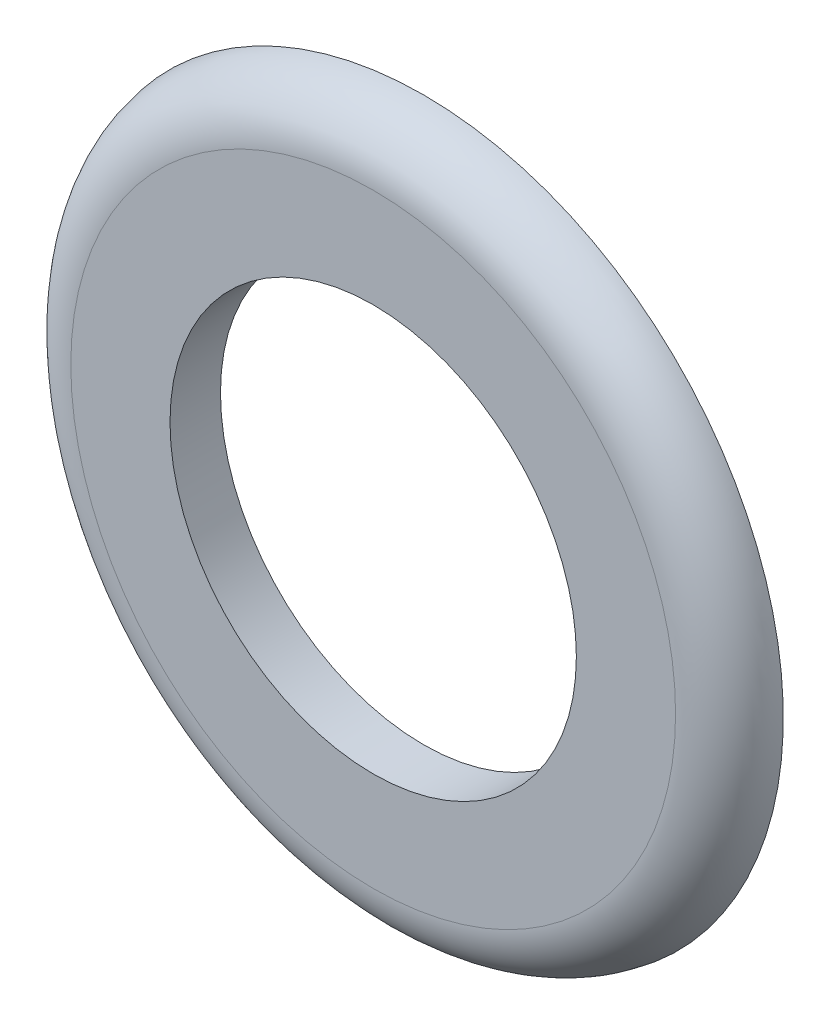
ISO-10303-21;
HEADER;
FILE_DESCRIPTION(('STEP AP214'),'2;1');
FILE_NAME('part.step','',(''),(''),'','','');
FILE_SCHEMA(('AUTOMOTIVE_DESIGN { 1 0 10303 214 1 1 1 1 }'));
ENDSEC;
DATA;
#1=APPLICATION_CONTEXT('core data for automotive mechanical design processes');
#2=APPLICATION_PROTOCOL_DEFINITION('international standard','automotive_design',2000,#1);
#3=PRODUCT_CONTEXT('',#1,'mechanical');
#4=PRODUCT('Part','Part','',(#3));
#5=PRODUCT_RELATED_PRODUCT_CATEGORY('part','',(#4));
#6=PRODUCT_DEFINITION_FORMATION('','',#4);
#7=PRODUCT_DEFINITION_CONTEXT('part definition',#1,'design');
#8=PRODUCT_DEFINITION('design','',#6,#7);
#9=PRODUCT_DEFINITION_SHAPE('','',#8);
#10=(LENGTH_UNIT() NAMED_UNIT(*) SI_UNIT(.MILLI.,.METRE.));
#11=(NAMED_UNIT(*) PLANE_ANGLE_UNIT() SI_UNIT($,.RADIAN.));
#12=(NAMED_UNIT(*) SI_UNIT($,.STERADIAN.) SOLID_ANGLE_UNIT());
#13=UNCERTAINTY_MEASURE_WITH_UNIT(LENGTH_MEASURE(1.E-05),#10,'distance_accuracy_value','');
#14=(GEOMETRIC_REPRESENTATION_CONTEXT(3) GLOBAL_UNCERTAINTY_ASSIGNED_CONTEXT((#13)) GLOBAL_UNIT_ASSIGNED_CONTEXT((#10,
#11,#12)) REPRESENTATION_CONTEXT('',''));
#15=CARTESIAN_POINT('',(0.,0.,0.));
#16=DIRECTION('',(0.,0.,1.));
#17=DIRECTION('',(1.,0.,0.));
#18=AXIS2_PLACEMENT_3D('',#15,#16,#17);
#19=CARTESIAN_POINT('',(0.,3.16666666666667,4.77139999999999));
#20=DIRECTION('',(0.,0.,1.));
#21=DIRECTION('',(0.,-1.,0.));
#22=AXIS2_PLACEMENT_3D('',#19,#20,#21);
#23=PLANE('',#22);
#24=CARTESIAN_POINT('',(0.,0.,4.77139999999999));
#25=DIRECTION('',(0.,0.,-1.));
#26=DIRECTION('',(0.,1.,0.));
#27=AXIS2_PLACEMENT_3D('',#24,#25,#26);
#28=CIRCLE('',#27,2.12772233940292);
#29=CARTESIAN_POINT('',(0.,2.12772233940292,4.77139999999999));
#30=VERTEX_POINT('',#29);
#31=EDGE_CURVE('E21',#30,#30,#28,.T.);
#32=ORIENTED_EDGE('',*,*,#31,.T.);
#33=EDGE_LOOP('',(#32));
#34=FACE_BOUND('',#33,.T.);
#35=CARTESIAN_POINT('',(0.,0.,4.7714));
#36=DIRECTION('',(0.,0.,-1.));
#37=DIRECTION('',(0.,1.,0.));
#38=AXIS2_PLACEMENT_3D('',#35,#36,#37);
#39=CIRCLE('',#38,3.16666666666668);
#40=CARTESIAN_POINT('',(0.,3.16666666666667,4.77139999999999));
#41=VERTEX_POINT('',#40);
#42=CARTESIAN_POINT('',(0.,-3.16666666666668,4.77139999999999));
#43=VERTEX_POINT('',#42);
#44=EDGE_CURVE('E33',#41,#43,#39,.T.);
#45=ORIENTED_EDGE('',*,*,#44,.F.);
#46=CARTESIAN_POINT('',(0.,0.,4.7714));
#47=DIRECTION('',(0.,0.,-1.));
#48=DIRECTION('',(0.,-1.,0.));
#49=AXIS2_PLACEMENT_3D('',#46,#47,#48);
#50=CIRCLE('',#49,3.16666666666667);
#51=EDGE_CURVE('E36',#43,#41,#50,.T.);
#52=ORIENTED_EDGE('',*,*,#51,.F.);
#53=EDGE_LOOP('',(#45,#52));
#54=FACE_BOUND('',#53,.T.);
#55=ADVANCED_FACE('F17',(#34,#54),#23,.T.);
#56=CARTESIAN_POINT('',(0.,0.,4.16666666666666));
#57=DIRECTION('',(0.,0.,-1.));
#58=DIRECTION('',(0.,1.,0.));
#59=AXIS2_PLACEMENT_3D('',#56,#57,#58);
#60=TOROIDAL_SURFACE('',#59,3.16666666666667,0.604733333333332);
#61=ORIENTED_EDGE('',*,*,#44,.T.);
#62=ORIENTED_EDGE('',*,*,#51,.T.);
#63=EDGE_LOOP('',(#61,#62));
#64=FACE_BOUND('',#63,.T.);
#65=CARTESIAN_POINT('',(0.,0.,4.24286666666666));
#66=DIRECTION('',(0.,0.,-1.));
#67=DIRECTION('',(0.,1.,0.));
#68=AXIS2_PLACEMENT_3D('',#65,#66,#67);
#69=CIRCLE('',#68,3.76657996410593);
#70=CARTESIAN_POINT('',(0.,3.76657996410593,4.24286666666666));
#71=VERTEX_POINT('',#70);
#72=EDGE_CURVE('E27',#71,#71,#69,.T.);
#73=ORIENTED_EDGE('',*,*,#72,.F.);
#74=EDGE_LOOP('',(#73));
#75=FACE_BOUND('',#74,.T.);
#76=ADVANCED_FACE('F43',(#64,#75),#60,.T.);
#77=CARTESIAN_POINT('',(0.,0.,4.24286666666666));
#78=DIRECTION('',(0.,0.,-1.));
#79=DIRECTION('',(0.,1.,0.));
#80=AXIS2_PLACEMENT_3D('',#77,#78,#79);
#81=CYLINDRICAL_SURFACE('',#80,2.12772233940292);
#82=CARTESIAN_POINT('',(0.,0.,4.24286666666666));
#83=DIRECTION('',(0.,0.,-1.));
#84=DIRECTION('',(0.,1.,0.));
#85=AXIS2_PLACEMENT_3D('',#82,#83,#84);
#86=CIRCLE('',#85,2.12772233940292);
#87=CARTESIAN_POINT('',(0.,2.12772233940292,4.24286666666666));
#88=VERTEX_POINT('',#87);
#89=EDGE_CURVE('E11',#88,#88,#86,.F.);
#90=ORIENTED_EDGE('',*,*,#89,.F.);
#91=EDGE_LOOP('',(#90));
#92=FACE_BOUND('',#91,.T.);
#93=ORIENTED_EDGE('',*,*,#31,.F.);
#94=EDGE_LOOP('',(#93));
#95=FACE_BOUND('',#94,.T.);
#96=ADVANCED_FACE('F60',(#92,#95),#81,.F.);
#97=CARTESIAN_POINT('',(0.,2.12772233940292,4.24286666666666));
#98=DIRECTION('',(0.,0.,-1.));
#99=DIRECTION('',(0.,1.,0.));
#100=AXIS2_PLACEMENT_3D('',#97,#98,#99);
#101=PLANE('',#100);
#102=ORIENTED_EDGE('',*,*,#89,.T.);
#103=EDGE_LOOP('',(#102));
#104=FACE_BOUND('',#103,.T.);
#105=ORIENTED_EDGE('',*,*,#72,.T.);
#106=EDGE_LOOP('',(#105));
#107=FACE_BOUND('',#106,.T.);
#108=ADVANCED_FACE('F86',(#104,#107),#101,.T.);
#109=CLOSED_SHELL('',(#55,#76,#96,#108));
#110=MANIFOLD_SOLID_BREP('B1',#109);
#111=ADVANCED_BREP_SHAPE_REPRESENTATION('',(#18,#110),#14);
#112=SHAPE_DEFINITION_REPRESENTATION(#9,#111);
ENDSEC;
END-ISO-10303-21;
